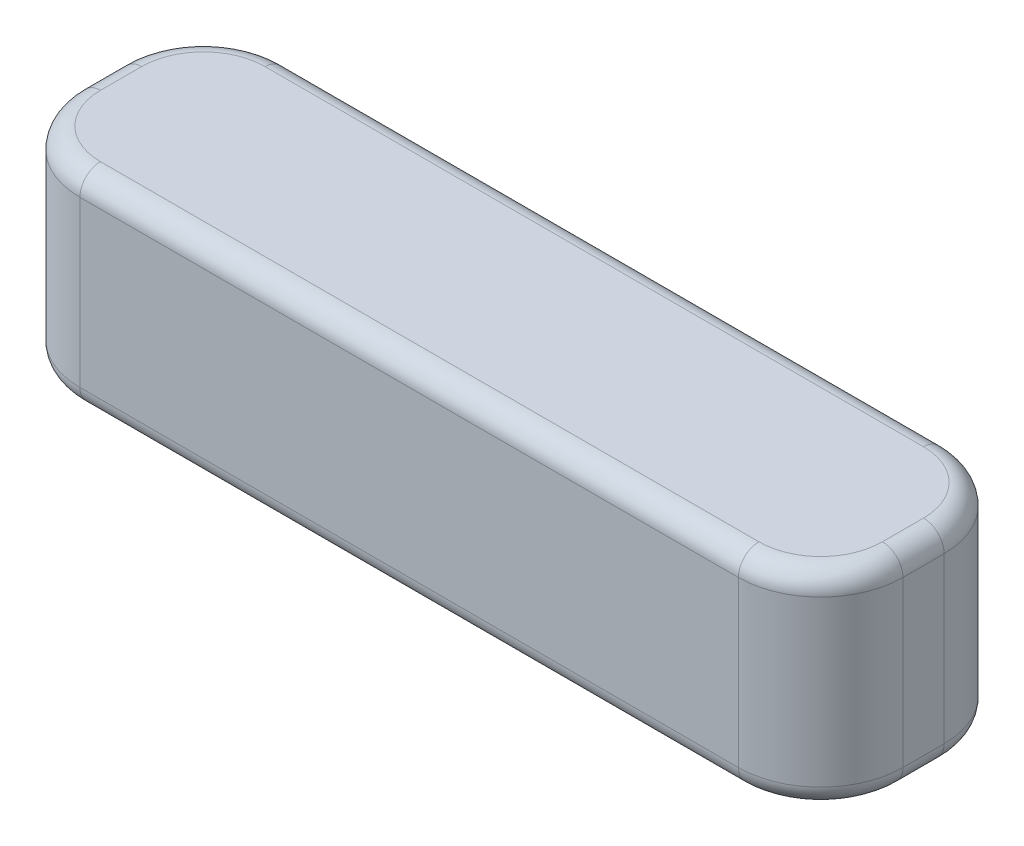
ISO-10303-21;
HEADER;
FILE_DESCRIPTION(('STEP AP214'),'2;1');
FILE_NAME('part.step','',(''),(''),'','','');
FILE_SCHEMA(('AUTOMOTIVE_DESIGN { 1 0 10303 214 1 1 1 1 }'));
ENDSEC;
DATA;
#1=APPLICATION_CONTEXT('core data for automotive mechanical design processes');
#2=APPLICATION_PROTOCOL_DEFINITION('international standard','automotive_design',2000,#1);
#3=PRODUCT_CONTEXT('',#1,'mechanical');
#4=PRODUCT('Part','Part','',(#3));
#5=PRODUCT_RELATED_PRODUCT_CATEGORY('part','',(#4));
#6=PRODUCT_DEFINITION_FORMATION('','',#4);
#7=PRODUCT_DEFINITION_CONTEXT('part definition',#1,'design');
#8=PRODUCT_DEFINITION('design','',#6,#7);
#9=PRODUCT_DEFINITION_SHAPE('','',#8);
#10=(LENGTH_UNIT() NAMED_UNIT(*) SI_UNIT(.MILLI.,.METRE.));
#11=(NAMED_UNIT(*) PLANE_ANGLE_UNIT() SI_UNIT($,.RADIAN.));
#12=(NAMED_UNIT(*) SI_UNIT($,.STERADIAN.) SOLID_ANGLE_UNIT());
#13=UNCERTAINTY_MEASURE_WITH_UNIT(LENGTH_MEASURE(1.E-05),#10,'distance_accuracy_value','');
#14=(GEOMETRIC_REPRESENTATION_CONTEXT(3) GLOBAL_UNCERTAINTY_ASSIGNED_CONTEXT((#13)) GLOBAL_UNIT_ASSIGNED_CONTEXT((#10,
#11,#12)) REPRESENTATION_CONTEXT('',''));
#15=CARTESIAN_POINT('',(0.,0.,0.));
#16=DIRECTION('',(0.,0.,1.));
#17=DIRECTION('',(1.,0.,0.));
#18=AXIS2_PLACEMENT_3D('',#15,#16,#17);
#19=CARTESIAN_POINT('',(10.,5.,-2.5));
#20=DIRECTION('',(-1.,0.,0.));
#21=DIRECTION('',(0.,0.,1.));
#22=AXIS2_PLACEMENT_3D('',#19,#20,#21);
#23=PLANE('',#22);
#24=DIRECTION('',(0.,-1.,0.));
#25=VECTOR('',#24,1.);
#26=CARTESIAN_POINT('',(10.,5.,0.5));
#27=LINE('',#26,#25);
#28=CARTESIAN_POINT('',(10.,4.5,0.5));
#29=VERTEX_POINT('',#28);
#30=CARTESIAN_POINT('',(10.,0.5,0.5));
#31=VERTEX_POINT('',#30);
#32=EDGE_CURVE('E172',#29,#31,#27,.T.);
#33=ORIENTED_EDGE('',*,*,#32,.T.);
#34=DIRECTION('',(0.,0.,-1.));
#35=VECTOR('',#34,1.);
#36=CARTESIAN_POINT('',(10.,0.5,-2.5));
#37=LINE('',#36,#35);
#38=CARTESIAN_POINT('',(10.,0.5,-0.5));
#39=VERTEX_POINT('',#38);
#40=EDGE_CURVE('E214',#31,#39,#37,.T.);
#41=ORIENTED_EDGE('',*,*,#40,.T.);
#42=DIRECTION('',(0.,-1.,0.));
#43=VECTOR('',#42,1.);
#44=CARTESIAN_POINT('',(10.,5.,-0.5));
#45=LINE('',#44,#43);
#46=CARTESIAN_POINT('',(10.,4.5,-0.5));
#47=VERTEX_POINT('',#46);
#48=EDGE_CURVE('E175',#39,#47,#45,.F.);
#49=ORIENTED_EDGE('',*,*,#48,.T.);
#50=DIRECTION('',(0.,0.,-1.));
#51=VECTOR('',#50,1.);
#52=CARTESIAN_POINT('',(10.,4.5,0.5));
#53=LINE('',#52,#51);
#54=EDGE_CURVE('E212',#47,#29,#53,.F.);
#55=ORIENTED_EDGE('',*,*,#54,.T.);
#56=EDGE_LOOP('',(#33,#41,#49,#55));
#57=FACE_BOUND('',#56,.T.);
#58=ADVANCED_FACE('F33',(#57),#23,.F.);
#59=CARTESIAN_POINT('',(-10.,5.,-2.5));
#60=DIRECTION('',(0.,0.,1.));
#61=DIRECTION('',(1.,0.,0.));
#62=AXIS2_PLACEMENT_3D('',#59,#60,#61);
#63=PLANE('',#62);
#64=DIRECTION('',(0.,-1.,0.));
#65=VECTOR('',#64,1.);
#66=CARTESIAN_POINT('',(8.,5.,-2.5));
#67=LINE('',#66,#65);
#68=CARTESIAN_POINT('',(8.,4.5,-2.5));
#69=VERTEX_POINT('',#68);
#70=CARTESIAN_POINT('',(8.,0.5,-2.5));
#71=VERTEX_POINT('',#70);
#72=EDGE_CURVE('E288',#69,#71,#67,.T.);
#73=ORIENTED_EDGE('',*,*,#72,.T.);
#74=DIRECTION('',(-1.,0.,0.));
#75=VECTOR('',#74,1.);
#76=CARTESIAN_POINT('',(-10.,0.5,-2.5));
#77=LINE('',#76,#75);
#78=CARTESIAN_POINT('',(-8.,0.5,-2.5));
#79=VERTEX_POINT('',#78);
#80=EDGE_CURVE('E206',#71,#79,#77,.T.);
#81=ORIENTED_EDGE('',*,*,#80,.T.);
#82=DIRECTION('',(0.,-1.,0.));
#83=VECTOR('',#82,1.);
#84=CARTESIAN_POINT('',(-8.,5.,-2.5));
#85=LINE('',#84,#83);
#86=CARTESIAN_POINT('',(-8.,4.5,-2.5));
#87=VERTEX_POINT('',#86);
#88=EDGE_CURVE('E299',#79,#87,#85,.F.);
#89=ORIENTED_EDGE('',*,*,#88,.T.);
#90=DIRECTION('',(-1.,0.,0.));
#91=VECTOR('',#90,1.);
#92=CARTESIAN_POINT('',(8.,4.5,-2.5));
#93=LINE('',#92,#91);
#94=EDGE_CURVE('E204',#87,#69,#93,.F.);
#95=ORIENTED_EDGE('',*,*,#94,.T.);
#96=EDGE_LOOP('',(#73,#81,#89,#95));
#97=FACE_BOUND('',#96,.T.);
#98=ADVANCED_FACE('F350',(#97),#63,.F.);
#99=CARTESIAN_POINT('',(-10.,5.,-2.5));
#100=DIRECTION('',(1.,0.,0.));
#101=DIRECTION('',(0.,0.,-1.));
#102=AXIS2_PLACEMENT_3D('',#99,#100,#101);
#103=PLANE('',#102);
#104=DIRECTION('',(0.,-1.,0.));
#105=VECTOR('',#104,1.);
#106=CARTESIAN_POINT('',(-10.,5.,-0.5));
#107=LINE('',#106,#105);
#108=CARTESIAN_POINT('',(-10.,4.5,-0.5));
#109=VERTEX_POINT('',#108);
#110=CARTESIAN_POINT('',(-10.,0.5,-0.5));
#111=VERTEX_POINT('',#110);
#112=EDGE_CURVE('E303',#109,#111,#107,.T.);
#113=ORIENTED_EDGE('',*,*,#112,.T.);
#114=DIRECTION('',(0.,0.,1.));
#115=VECTOR('',#114,1.);
#116=CARTESIAN_POINT('',(-10.,0.5,-2.5));
#117=LINE('',#116,#115);
#118=CARTESIAN_POINT('',(-10.,0.5,0.5));
#119=VERTEX_POINT('',#118);
#120=EDGE_CURVE('E198',#111,#119,#117,.T.);
#121=ORIENTED_EDGE('',*,*,#120,.T.);
#122=DIRECTION('',(0.,-1.,0.));
#123=VECTOR('',#122,1.);
#124=CARTESIAN_POINT('',(-10.,5.,0.5));
#125=LINE('',#124,#123);
#126=CARTESIAN_POINT('',(-10.,4.5,0.5));
#127=VERTEX_POINT('',#126);
#128=EDGE_CURVE('E249',#119,#127,#125,.F.);
#129=ORIENTED_EDGE('',*,*,#128,.T.);
#130=DIRECTION('',(0.,0.,1.));
#131=VECTOR('',#130,1.);
#132=CARTESIAN_POINT('',(-10.,4.5,-0.5));
#133=LINE('',#132,#131);
#134=EDGE_CURVE('E196',#127,#109,#133,.F.);
#135=ORIENTED_EDGE('',*,*,#134,.T.);
#136=EDGE_LOOP('',(#113,#121,#129,#135));
#137=FACE_BOUND('',#136,.T.);
#138=ADVANCED_FACE('F309',(#137),#103,.F.);
#139=CARTESIAN_POINT('',(-10.,5.,2.5));
#140=DIRECTION('',(0.,0.,-1.));
#141=DIRECTION('',(-1.,0.,0.));
#142=AXIS2_PLACEMENT_3D('',#139,#140,#141);
#143=PLANE('',#142);
#144=DIRECTION('',(0.,-1.,0.));
#145=VECTOR('',#144,1.);
#146=CARTESIAN_POINT('',(-8.,5.,2.5));
#147=LINE('',#146,#145);
#148=CARTESIAN_POINT('',(-8.,4.5,2.5));
#149=VERTEX_POINT('',#148);
#150=CARTESIAN_POINT('',(-8.,0.5,2.5));
#151=VERTEX_POINT('',#150);
#152=EDGE_CURVE('E292',#149,#151,#147,.T.);
#153=ORIENTED_EDGE('',*,*,#152,.T.);
#154=DIRECTION('',(1.,0.,0.));
#155=VECTOR('',#154,1.);
#156=CARTESIAN_POINT('',(-10.,0.5,2.5));
#157=LINE('',#156,#155);
#158=CARTESIAN_POINT('',(8.,0.5,2.5));
#159=VERTEX_POINT('',#158);
#160=EDGE_CURVE('E11',#151,#159,#157,.T.);
#161=ORIENTED_EDGE('',*,*,#160,.T.);
#162=DIRECTION('',(0.,-1.,0.));
#163=VECTOR('',#162,1.);
#164=CARTESIAN_POINT('',(8.,5.,2.5));
#165=LINE('',#164,#163);
#166=CARTESIAN_POINT('',(8.,4.5,2.5));
#167=VERTEX_POINT('',#166);
#168=EDGE_CURVE('E294',#159,#167,#165,.F.);
#169=ORIENTED_EDGE('',*,*,#168,.T.);
#170=DIRECTION('',(1.,0.,0.));
#171=VECTOR('',#170,1.);
#172=CARTESIAN_POINT('',(-8.,4.5,2.5));
#173=LINE('',#172,#171);
#174=EDGE_CURVE('E42',#167,#149,#173,.F.);
#175=ORIENTED_EDGE('',*,*,#174,.T.);
#176=EDGE_LOOP('',(#153,#161,#169,#175));
#177=FACE_BOUND('',#176,.T.);
#178=ADVANCED_FACE('F532',(#177),#143,.F.);
#179=CARTESIAN_POINT('',(0.,5.,0.));
#180=DIRECTION('',(0.,1.,0.));
#181=DIRECTION('',(0.,0.,1.));
#182=AXIS2_PLACEMENT_3D('',#179,#180,#181);
#183=PLANE('',#182);
#184=DIRECTION('',(0.,0.,1.));
#185=VECTOR('',#184,1.);
#186=CARTESIAN_POINT('',(-9.5,5.,0.5));
#187=LINE('',#186,#185);
#188=CARTESIAN_POINT('',(-9.5,5.,-0.5));
#189=VERTEX_POINT('',#188);
#190=CARTESIAN_POINT('',(-9.5,5.,0.5));
#191=VERTEX_POINT('',#190);
#192=EDGE_CURVE('E50',#189,#191,#187,.T.);
#193=ORIENTED_EDGE('',*,*,#192,.T.);
#194=CARTESIAN_POINT('',(-8.,5.,0.5));
#195=DIRECTION('',(0.,1.,0.));
#196=DIRECTION('',(0.,0.,1.));
#197=AXIS2_PLACEMENT_3D('',#194,#195,#196);
#198=CIRCLE('',#197,1.5);
#199=CARTESIAN_POINT('',(-8.,5.,2.));
#200=VERTEX_POINT('',#199);
#201=EDGE_CURVE('E231',#191,#200,#198,.T.);
#202=ORIENTED_EDGE('',*,*,#201,.T.);
#203=DIRECTION('',(1.,0.,0.));
#204=VECTOR('',#203,1.);
#205=CARTESIAN_POINT('',(8.,5.,2.));
#206=LINE('',#205,#204);
#207=CARTESIAN_POINT('',(8.,5.,2.));
#208=VERTEX_POINT('',#207);
#209=EDGE_CURVE('E219',#200,#208,#206,.T.);
#210=ORIENTED_EDGE('',*,*,#209,.T.);
#211=CARTESIAN_POINT('',(8.,5.,0.5));
#212=DIRECTION('',(0.,1.,0.));
#213=DIRECTION('',(0.,0.,1.));
#214=AXIS2_PLACEMENT_3D('',#211,#212,#213);
#215=CIRCLE('',#214,1.5);
#216=CARTESIAN_POINT('',(9.5,5.,0.5));
#217=VERTEX_POINT('',#216);
#218=EDGE_CURVE('E221',#208,#217,#215,.T.);
#219=ORIENTED_EDGE('',*,*,#218,.T.);
#220=DIRECTION('',(0.,0.,-1.));
#221=VECTOR('',#220,1.);
#222=CARTESIAN_POINT('',(9.5,5.,-0.5));
#223=LINE('',#222,#221);
#224=CARTESIAN_POINT('',(9.5,5.,-0.5));
#225=VERTEX_POINT('',#224);
#226=EDGE_CURVE('E223',#217,#225,#223,.T.);
#227=ORIENTED_EDGE('',*,*,#226,.T.);
#228=CARTESIAN_POINT('',(8.,5.,-0.5));
#229=DIRECTION('',(0.,1.,0.));
#230=DIRECTION('',(0.,0.,1.));
#231=AXIS2_PLACEMENT_3D('',#228,#229,#230);
#232=CIRCLE('',#231,1.5);
#233=CARTESIAN_POINT('',(8.,5.,-2.));
#234=VERTEX_POINT('',#233);
#235=EDGE_CURVE('E225',#225,#234,#232,.T.);
#236=ORIENTED_EDGE('',*,*,#235,.T.);
#237=DIRECTION('',(-1.,0.,0.));
#238=VECTOR('',#237,1.);
#239=CARTESIAN_POINT('',(-8.,5.,-2.));
#240=LINE('',#239,#238);
#241=CARTESIAN_POINT('',(-8.,5.,-2.));
#242=VERTEX_POINT('',#241);
#243=EDGE_CURVE('E227',#234,#242,#240,.T.);
#244=ORIENTED_EDGE('',*,*,#243,.T.);
#245=CARTESIAN_POINT('',(-8.,5.,-0.5));
#246=DIRECTION('',(0.,1.,0.));
#247=DIRECTION('',(0.,0.,1.));
#248=AXIS2_PLACEMENT_3D('',#245,#246,#247);
#249=CIRCLE('',#248,1.5);
#250=EDGE_CURVE('E55',#242,#189,#249,.T.);
#251=ORIENTED_EDGE('',*,*,#250,.T.);
#252=EDGE_LOOP('',(#193,#202,#210,#219,#227,#236,#244,#251));
#253=FACE_BOUND('',#252,.T.);
#254=ADVANCED_FACE('F524',(#253),#183,.T.);
#255=CARTESIAN_POINT('',(0.,0.,0.));
#256=DIRECTION('',(0.,1.,0.));
#257=DIRECTION('',(0.,0.,1.));
#258=AXIS2_PLACEMENT_3D('',#255,#256,#257);
#259=PLANE('',#258);
#260=DIRECTION('',(1.,0.,0.));
#261=VECTOR('',#260,1.);
#262=CARTESIAN_POINT('',(0.,0.,2.));
#263=LINE('',#262,#261);
#264=CARTESIAN_POINT('',(8.,0.,2.));
#265=VERTEX_POINT('',#264);
#266=CARTESIAN_POINT('',(-8.,0.,2.));
#267=VERTEX_POINT('',#266);
#268=EDGE_CURVE('E151',#265,#267,#263,.F.);
#269=ORIENTED_EDGE('',*,*,#268,.T.);
#270=CARTESIAN_POINT('',(-8.,0.,0.5));
#271=DIRECTION('',(0.,1.,0.));
#272=DIRECTION('',(0.,0.,1.));
#273=AXIS2_PLACEMENT_3D('',#270,#271,#272);
#274=CIRCLE('',#273,1.5);
#275=CARTESIAN_POINT('',(-9.5,0.,0.5));
#276=VERTEX_POINT('',#275);
#277=EDGE_CURVE('E188',#267,#276,#274,.F.);
#278=ORIENTED_EDGE('',*,*,#277,.T.);
#279=DIRECTION('',(0.,0.,1.));
#280=VECTOR('',#279,1.);
#281=CARTESIAN_POINT('',(-9.5,0.,0.));
#282=LINE('',#281,#280);
#283=CARTESIAN_POINT('',(-9.5,0.,-0.5));
#284=VERTEX_POINT('',#283);
#285=EDGE_CURVE('E186',#276,#284,#282,.F.);
#286=ORIENTED_EDGE('',*,*,#285,.T.);
#287=CARTESIAN_POINT('',(-8.,0.,-0.5));
#288=DIRECTION('',(0.,1.,0.));
#289=DIRECTION('',(0.,0.,1.));
#290=AXIS2_PLACEMENT_3D('',#287,#288,#289);
#291=CIRCLE('',#290,1.5);
#292=CARTESIAN_POINT('',(-8.,0.,-2.));
#293=VERTEX_POINT('',#292);
#294=EDGE_CURVE('E184',#284,#293,#291,.F.);
#295=ORIENTED_EDGE('',*,*,#294,.T.);
#296=DIRECTION('',(-1.,0.,0.));
#297=VECTOR('',#296,1.);
#298=CARTESIAN_POINT('',(0.,0.,-2.));
#299=LINE('',#298,#297);
#300=CARTESIAN_POINT('',(8.,0.,-2.));
#301=VERTEX_POINT('',#300);
#302=EDGE_CURVE('E182',#293,#301,#299,.F.);
#303=ORIENTED_EDGE('',*,*,#302,.T.);
#304=CARTESIAN_POINT('',(8.,0.,-0.5));
#305=DIRECTION('',(0.,1.,0.));
#306=DIRECTION('',(0.,0.,1.));
#307=AXIS2_PLACEMENT_3D('',#304,#305,#306);
#308=CIRCLE('',#307,1.5);
#309=CARTESIAN_POINT('',(9.5,0.,-0.5));
#310=VERTEX_POINT('',#309);
#311=EDGE_CURVE('E180',#301,#310,#308,.F.);
#312=ORIENTED_EDGE('',*,*,#311,.T.);
#313=DIRECTION('',(0.,0.,-1.));
#314=VECTOR('',#313,1.);
#315=CARTESIAN_POINT('',(9.5,0.,0.));
#316=LINE('',#315,#314);
#317=CARTESIAN_POINT('',(9.5,0.,0.5));
#318=VERTEX_POINT('',#317);
#319=EDGE_CURVE('E154',#310,#318,#316,.F.);
#320=ORIENTED_EDGE('',*,*,#319,.T.);
#321=CARTESIAN_POINT('',(8.,0.,0.5));
#322=DIRECTION('',(0.,1.,0.));
#323=DIRECTION('',(0.,0.,1.));
#324=AXIS2_PLACEMENT_3D('',#321,#322,#323);
#325=CIRCLE('',#324,1.5);
#326=EDGE_CURVE('E146',#318,#265,#325,.F.);
#327=ORIENTED_EDGE('',*,*,#326,.T.);
#328=EDGE_LOOP('',(#269,#278,#286,#295,#303,#312,#320,#327));
#329=FACE_BOUND('',#328,.T.);
#330=ADVANCED_FACE('F148',(#329),#259,.F.);
#331=CARTESIAN_POINT('',(-8.,5.,-0.5));
#332=DIRECTION('',(0.,-1.,0.));
#333=DIRECTION('',(0.,0.,-1.));
#334=AXIS2_PLACEMENT_3D('',#331,#332,#333);
#335=CYLINDRICAL_SURFACE('',#334,2.);
#336=ORIENTED_EDGE('',*,*,#88,.F.);
#337=CARTESIAN_POINT('',(-8.,0.5,-0.5));
#338=DIRECTION('',(0.,1.,0.));
#339=DIRECTION('',(0.,0.,1.));
#340=AXIS2_PLACEMENT_3D('',#337,#338,#339);
#341=CIRCLE('',#340,2.);
#342=EDGE_CURVE('E202',#79,#111,#341,.T.);
#343=ORIENTED_EDGE('',*,*,#342,.T.);
#344=ORIENTED_EDGE('',*,*,#112,.F.);
#345=CARTESIAN_POINT('',(-8.,4.5,-0.5));
#346=DIRECTION('',(0.,1.,0.));
#347=DIRECTION('',(0.,0.,1.));
#348=AXIS2_PLACEMENT_3D('',#345,#346,#347);
#349=CIRCLE('',#348,2.);
#350=EDGE_CURVE('E200',#109,#87,#349,.F.);
#351=ORIENTED_EDGE('',*,*,#350,.T.);
#352=EDGE_LOOP('',(#336,#343,#344,#351));
#353=FACE_BOUND('',#352,.T.);
#354=ADVANCED_FACE('F359',(#353),#335,.T.);
#355=CARTESIAN_POINT('',(-8.,5.,0.5));
#356=DIRECTION('',(0.,-1.,0.));
#357=DIRECTION('',(0.,0.,-1.));
#358=AXIS2_PLACEMENT_3D('',#355,#356,#357);
#359=CYLINDRICAL_SURFACE('',#358,2.);
#360=ORIENTED_EDGE('',*,*,#128,.F.);
#361=CARTESIAN_POINT('',(-8.,0.5,0.5));
#362=DIRECTION('',(0.,1.,0.));
#363=DIRECTION('',(0.,0.,1.));
#364=AXIS2_PLACEMENT_3D('',#361,#362,#363);
#365=CIRCLE('',#364,2.);
#366=EDGE_CURVE('E193',#119,#151,#365,.T.);
#367=ORIENTED_EDGE('',*,*,#366,.T.);
#368=ORIENTED_EDGE('',*,*,#152,.F.);
#369=CARTESIAN_POINT('',(-8.,4.5,0.5));
#370=DIRECTION('',(0.,1.,0.));
#371=DIRECTION('',(0.,0.,1.));
#372=AXIS2_PLACEMENT_3D('',#369,#370,#371);
#373=CIRCLE('',#372,2.);
#374=EDGE_CURVE('E190',#149,#127,#373,.F.);
#375=ORIENTED_EDGE('',*,*,#374,.T.);
#376=EDGE_LOOP('',(#360,#367,#368,#375));
#377=FACE_BOUND('',#376,.T.);
#378=ADVANCED_FACE('F315',(#377),#359,.T.);
#379=CARTESIAN_POINT('',(8.,5.,0.5));
#380=DIRECTION('',(0.,-1.,0.));
#381=DIRECTION('',(0.,0.,-1.));
#382=AXIS2_PLACEMENT_3D('',#379,#380,#381);
#383=CYLINDRICAL_SURFACE('',#382,2.);
#384=ORIENTED_EDGE('',*,*,#168,.F.);
#385=CARTESIAN_POINT('',(8.,0.5,0.5));
#386=DIRECTION('',(0.,1.,0.));
#387=DIRECTION('',(0.,0.,1.));
#388=AXIS2_PLACEMENT_3D('',#385,#386,#387);
#389=CIRCLE('',#388,2.);
#390=EDGE_CURVE('E163',#159,#31,#389,.T.);
#391=ORIENTED_EDGE('',*,*,#390,.T.);
#392=ORIENTED_EDGE('',*,*,#32,.F.);
#393=CARTESIAN_POINT('',(8.,4.5,0.5));
#394=DIRECTION('',(0.,1.,0.));
#395=DIRECTION('',(0.,0.,1.));
#396=AXIS2_PLACEMENT_3D('',#393,#394,#395);
#397=CIRCLE('',#396,2.);
#398=EDGE_CURVE('E216',#29,#167,#397,.F.);
#399=ORIENTED_EDGE('',*,*,#398,.T.);
#400=EDGE_LOOP('',(#384,#391,#392,#399));
#401=FACE_BOUND('',#400,.T.);
#402=ADVANCED_FACE('F365',(#401),#383,.T.);
#403=CARTESIAN_POINT('',(8.,5.,-0.5));
#404=DIRECTION('',(0.,-1.,0.));
#405=DIRECTION('',(0.,0.,-1.));
#406=AXIS2_PLACEMENT_3D('',#403,#404,#405);
#407=CYLINDRICAL_SURFACE('',#406,2.);
#408=ORIENTED_EDGE('',*,*,#48,.F.);
#409=CARTESIAN_POINT('',(8.,0.5,-0.5));
#410=DIRECTION('',(0.,1.,0.));
#411=DIRECTION('',(0.,0.,1.));
#412=AXIS2_PLACEMENT_3D('',#409,#410,#411);
#413=CIRCLE('',#412,2.);
#414=EDGE_CURVE('E210',#39,#71,#413,.T.);
#415=ORIENTED_EDGE('',*,*,#414,.T.);
#416=ORIENTED_EDGE('',*,*,#72,.F.);
#417=CARTESIAN_POINT('',(8.,4.5,-0.5));
#418=DIRECTION('',(0.,1.,0.));
#419=DIRECTION('',(0.,0.,1.));
#420=AXIS2_PLACEMENT_3D('',#417,#418,#419);
#421=CIRCLE('',#420,2.);
#422=EDGE_CURVE('E208',#69,#47,#421,.F.);
#423=ORIENTED_EDGE('',*,*,#422,.T.);
#424=EDGE_LOOP('',(#408,#415,#416,#423));
#425=FACE_BOUND('',#424,.T.);
#426=ADVANCED_FACE('F285',(#425),#407,.T.);
#427=CARTESIAN_POINT('',(8.,0.5,-0.5));
#428=DIRECTION('',(0.,1.,0.));
#429=DIRECTION('',(0.,0.,1.));
#430=AXIS2_PLACEMENT_3D('',#427,#428,#429);
#431=TOROIDAL_SURFACE('',#430,1.5,0.5);
#432=CARTESIAN_POINT('',(8.,0.5,-2.));
#433=DIRECTION('',(-1.,0.,0.));
#434=DIRECTION('',(0.,0.,1.));
#435=AXIS2_PLACEMENT_3D('',#432,#433,#434);
#436=CIRCLE('',#435,0.5);
#437=EDGE_CURVE('E243',#71,#301,#436,.T.);
#438=ORIENTED_EDGE('',*,*,#437,.F.);
#439=ORIENTED_EDGE('',*,*,#414,.F.);
#440=CARTESIAN_POINT('',(9.5,0.5,-0.5));
#441=DIRECTION('',(0.,0.,1.));
#442=DIRECTION('',(1.,0.,0.));
#443=AXIS2_PLACEMENT_3D('',#440,#441,#442);
#444=CIRCLE('',#443,0.5);
#445=EDGE_CURVE('E246',#310,#39,#444,.T.);
#446=ORIENTED_EDGE('',*,*,#445,.F.);
#447=ORIENTED_EDGE('',*,*,#311,.F.);
#448=EDGE_LOOP('',(#438,#439,#446,#447));
#449=FACE_BOUND('',#448,.T.);
#450=ADVANCED_FACE('F338',(#449),#431,.T.);
#451=CARTESIAN_POINT('',(9.5,0.5,-2.5));
#452=DIRECTION('',(0.,0.,-1.));
#453=DIRECTION('',(-1.,0.,0.));
#454=AXIS2_PLACEMENT_3D('',#451,#452,#453);
#455=CYLINDRICAL_SURFACE('',#454,0.5);
#456=ORIENTED_EDGE('',*,*,#445,.T.);
#457=ORIENTED_EDGE('',*,*,#40,.F.);
#458=CARTESIAN_POINT('',(9.5,0.5,0.5));
#459=DIRECTION('',(0.,0.,1.));
#460=DIRECTION('',(1.,0.,0.));
#461=AXIS2_PLACEMENT_3D('',#458,#459,#460);
#462=CIRCLE('',#461,0.5);
#463=EDGE_CURVE('E241',#318,#31,#462,.T.);
#464=ORIENTED_EDGE('',*,*,#463,.F.);
#465=ORIENTED_EDGE('',*,*,#319,.F.);
#466=EDGE_LOOP('',(#456,#457,#464,#465));
#467=FACE_BOUND('',#466,.T.);
#468=ADVANCED_FACE('F340',(#467),#455,.T.);
#469=CARTESIAN_POINT('',(-10.,0.5,-2.));
#470=DIRECTION('',(-1.,0.,0.));
#471=DIRECTION('',(0.,0.,1.));
#472=AXIS2_PLACEMENT_3D('',#469,#470,#471);
#473=CYLINDRICAL_SURFACE('',#472,0.5);
#474=ORIENTED_EDGE('',*,*,#437,.T.);
#475=ORIENTED_EDGE('',*,*,#302,.F.);
#476=CARTESIAN_POINT('',(-8.,0.5,-2.));
#477=DIRECTION('',(-1.,0.,0.));
#478=DIRECTION('',(0.,0.,1.));
#479=AXIS2_PLACEMENT_3D('',#476,#477,#478);
#480=CIRCLE('',#479,0.5);
#481=EDGE_CURVE('E166',#79,#293,#480,.T.);
#482=ORIENTED_EDGE('',*,*,#481,.F.);
#483=ORIENTED_EDGE('',*,*,#80,.F.);
#484=EDGE_LOOP('',(#474,#475,#482,#483));
#485=FACE_BOUND('',#484,.T.);
#486=ADVANCED_FACE('F333',(#485),#473,.T.);
#487=CARTESIAN_POINT('',(8.,0.5,0.5));
#488=DIRECTION('',(0.,1.,0.));
#489=DIRECTION('',(0.,0.,1.));
#490=AXIS2_PLACEMENT_3D('',#487,#488,#489);
#491=TOROIDAL_SURFACE('',#490,1.5,0.5);
#492=ORIENTED_EDGE('',*,*,#463,.T.);
#493=ORIENTED_EDGE('',*,*,#390,.F.);
#494=CARTESIAN_POINT('',(8.,0.5,2.));
#495=DIRECTION('',(-1.,0.,0.));
#496=DIRECTION('',(0.,0.,1.));
#497=AXIS2_PLACEMENT_3D('',#494,#495,#496);
#498=CIRCLE('',#497,0.5);
#499=EDGE_CURVE('E161',#265,#159,#498,.T.);
#500=ORIENTED_EDGE('',*,*,#499,.F.);
#501=ORIENTED_EDGE('',*,*,#326,.F.);
#502=EDGE_LOOP('',(#492,#493,#500,#501));
#503=FACE_BOUND('',#502,.T.);
#504=ADVANCED_FACE('F162',(#503),#491,.T.);
#505=CARTESIAN_POINT('',(-8.,0.5,-0.5));
#506=DIRECTION('',(0.,1.,0.));
#507=DIRECTION('',(0.,0.,1.));
#508=AXIS2_PLACEMENT_3D('',#505,#506,#507);
#509=TOROIDAL_SURFACE('',#508,1.5,0.5);
#510=ORIENTED_EDGE('',*,*,#481,.T.);
#511=ORIENTED_EDGE('',*,*,#294,.F.);
#512=CARTESIAN_POINT('',(-9.5,0.5,-0.5));
#513=DIRECTION('',(0.,0.,1.));
#514=DIRECTION('',(1.,0.,0.));
#515=AXIS2_PLACEMENT_3D('',#512,#513,#514);
#516=CIRCLE('',#515,0.5);
#517=EDGE_CURVE('E167',#111,#284,#516,.T.);
#518=ORIENTED_EDGE('',*,*,#517,.F.);
#519=ORIENTED_EDGE('',*,*,#342,.F.);
#520=EDGE_LOOP('',(#510,#511,#518,#519));
#521=FACE_BOUND('',#520,.T.);
#522=ADVANCED_FACE('F328',(#521),#509,.T.);
#523=CARTESIAN_POINT('',(-10.,0.5,2.));
#524=DIRECTION('',(1.,0.,0.));
#525=DIRECTION('',(0.,0.,-1.));
#526=AXIS2_PLACEMENT_3D('',#523,#524,#525);
#527=CYLINDRICAL_SURFACE('',#526,0.5);
#528=ORIENTED_EDGE('',*,*,#499,.T.);
#529=ORIENTED_EDGE('',*,*,#160,.F.);
#530=CARTESIAN_POINT('',(-8.,0.5,2.));
#531=DIRECTION('',(-1.,0.,0.));
#532=DIRECTION('',(0.,0.,1.));
#533=AXIS2_PLACEMENT_3D('',#530,#531,#532);
#534=CIRCLE('',#533,0.5);
#535=EDGE_CURVE('E170',#267,#151,#534,.T.);
#536=ORIENTED_EDGE('',*,*,#535,.F.);
#537=ORIENTED_EDGE('',*,*,#268,.F.);
#538=EDGE_LOOP('',(#528,#529,#536,#537));
#539=FACE_BOUND('',#538,.T.);
#540=ADVANCED_FACE('F169',(#539),#527,.T.);
#541=CARTESIAN_POINT('',(-9.5,0.5,-2.5));
#542=DIRECTION('',(0.,0.,1.));
#543=DIRECTION('',(1.,0.,0.));
#544=AXIS2_PLACEMENT_3D('',#541,#542,#543);
#545=CYLINDRICAL_SURFACE('',#544,0.5);
#546=ORIENTED_EDGE('',*,*,#517,.T.);
#547=ORIENTED_EDGE('',*,*,#285,.F.);
#548=CARTESIAN_POINT('',(-9.5,0.5,0.5));
#549=DIRECTION('',(0.,0.,1.));
#550=DIRECTION('',(1.,0.,0.));
#551=AXIS2_PLACEMENT_3D('',#548,#549,#550);
#552=CIRCLE('',#551,0.5);
#553=EDGE_CURVE('E234',#119,#276,#552,.T.);
#554=ORIENTED_EDGE('',*,*,#553,.F.);
#555=ORIENTED_EDGE('',*,*,#120,.F.);
#556=EDGE_LOOP('',(#546,#547,#554,#555));
#557=FACE_BOUND('',#556,.T.);
#558=ADVANCED_FACE('F323',(#557),#545,.T.);
#559=CARTESIAN_POINT('',(-8.,0.5,0.5));
#560=DIRECTION('',(0.,1.,0.));
#561=DIRECTION('',(0.,0.,1.));
#562=AXIS2_PLACEMENT_3D('',#559,#560,#561);
#563=TOROIDAL_SURFACE('',#562,1.5,0.5);
#564=ORIENTED_EDGE('',*,*,#535,.T.);
#565=ORIENTED_EDGE('',*,*,#366,.F.);
#566=ORIENTED_EDGE('',*,*,#553,.T.);
#567=ORIENTED_EDGE('',*,*,#277,.F.);
#568=EDGE_LOOP('',(#564,#565,#566,#567));
#569=FACE_BOUND('',#568,.T.);
#570=ADVANCED_FACE('F320',(#569),#563,.T.);
#571=CARTESIAN_POINT('',(8.,4.5,-0.5));
#572=DIRECTION('',(0.,1.,0.));
#573=DIRECTION('',(0.,0.,1.));
#574=AXIS2_PLACEMENT_3D('',#571,#572,#573);
#575=TOROIDAL_SURFACE('',#574,1.5,0.5);
#576=CARTESIAN_POINT('',(9.5,4.5,-0.5));
#577=DIRECTION('',(0.,0.,1.));
#578=DIRECTION('',(1.,0.,0.));
#579=AXIS2_PLACEMENT_3D('',#576,#577,#578);
#580=CIRCLE('',#579,0.5);
#581=EDGE_CURVE('E265',#47,#225,#580,.T.);
#582=ORIENTED_EDGE('',*,*,#581,.F.);
#583=ORIENTED_EDGE('',*,*,#422,.F.);
#584=CARTESIAN_POINT('',(8.,4.5,-2.));
#585=DIRECTION('',(-1.,0.,0.));
#586=DIRECTION('',(0.,0.,1.));
#587=AXIS2_PLACEMENT_3D('',#584,#585,#586);
#588=CIRCLE('',#587,0.5);
#589=EDGE_CURVE('E37',#234,#69,#588,.T.);
#590=ORIENTED_EDGE('',*,*,#589,.F.);
#591=ORIENTED_EDGE('',*,*,#235,.F.);
#592=EDGE_LOOP('',(#582,#583,#590,#591));
#593=FACE_BOUND('',#592,.T.);
#594=ADVANCED_FACE('F35',(#593),#575,.T.);
#595=CARTESIAN_POINT('',(0.,4.5,-2.));
#596=DIRECTION('',(1.,0.,0.));
#597=DIRECTION('',(0.,0.,-1.));
#598=AXIS2_PLACEMENT_3D('',#595,#596,#597);
#599=CYLINDRICAL_SURFACE('',#598,0.5);
#600=ORIENTED_EDGE('',*,*,#589,.T.);
#601=ORIENTED_EDGE('',*,*,#94,.F.);
#602=CARTESIAN_POINT('',(-8.,4.5,-2.));
#603=DIRECTION('',(-1.,0.,0.));
#604=DIRECTION('',(0.,0.,1.));
#605=AXIS2_PLACEMENT_3D('',#602,#603,#604);
#606=CIRCLE('',#605,0.5);
#607=EDGE_CURVE('E263',#242,#87,#606,.T.);
#608=ORIENTED_EDGE('',*,*,#607,.F.);
#609=ORIENTED_EDGE('',*,*,#243,.F.);
#610=EDGE_LOOP('',(#600,#601,#608,#609));
#611=FACE_BOUND('',#610,.T.);
#612=ADVANCED_FACE('F276',(#611),#599,.T.);
#613=CARTESIAN_POINT('',(9.5,4.5,0.));
#614=DIRECTION('',(0.,0.,1.));
#615=DIRECTION('',(1.,0.,0.));
#616=AXIS2_PLACEMENT_3D('',#613,#614,#615);
#617=CYLINDRICAL_SURFACE('',#616,0.5);
#618=ORIENTED_EDGE('',*,*,#581,.T.);
#619=ORIENTED_EDGE('',*,*,#226,.F.);
#620=CARTESIAN_POINT('',(9.5,4.5,0.5));
#621=DIRECTION('',(0.,0.,1.));
#622=DIRECTION('',(1.,0.,0.));
#623=AXIS2_PLACEMENT_3D('',#620,#621,#622);
#624=CIRCLE('',#623,0.5);
#625=EDGE_CURVE('E260',#29,#217,#624,.T.);
#626=ORIENTED_EDGE('',*,*,#625,.F.);
#627=ORIENTED_EDGE('',*,*,#54,.F.);
#628=EDGE_LOOP('',(#618,#619,#626,#627));
#629=FACE_BOUND('',#628,.T.);
#630=ADVANCED_FACE('F411',(#629),#617,.T.);
#631=CARTESIAN_POINT('',(-8.,4.5,-0.5));
#632=DIRECTION('',(0.,1.,0.));
#633=DIRECTION('',(0.,0.,1.));
#634=AXIS2_PLACEMENT_3D('',#631,#632,#633);
#635=TOROIDAL_SURFACE('',#634,1.5,0.5);
#636=ORIENTED_EDGE('',*,*,#607,.T.);
#637=ORIENTED_EDGE('',*,*,#350,.F.);
#638=CARTESIAN_POINT('',(-9.5,4.5,-0.5));
#639=DIRECTION('',(0.,0.,1.));
#640=DIRECTION('',(1.,0.,0.));
#641=AXIS2_PLACEMENT_3D('',#638,#639,#640);
#642=CIRCLE('',#641,0.5);
#643=EDGE_CURVE('E257',#189,#109,#642,.T.);
#644=ORIENTED_EDGE('',*,*,#643,.F.);
#645=ORIENTED_EDGE('',*,*,#250,.F.);
#646=EDGE_LOOP('',(#636,#637,#644,#645));
#647=FACE_BOUND('',#646,.T.);
#648=ADVANCED_FACE('F417',(#647),#635,.T.);
#649=CARTESIAN_POINT('',(8.,4.5,0.5));
#650=DIRECTION('',(0.,1.,0.));
#651=DIRECTION('',(0.,0.,1.));
#652=AXIS2_PLACEMENT_3D('',#649,#650,#651);
#653=TOROIDAL_SURFACE('',#652,1.5,0.5);
#654=ORIENTED_EDGE('',*,*,#625,.T.);
#655=ORIENTED_EDGE('',*,*,#218,.F.);
#656=CARTESIAN_POINT('',(8.,4.5,2.));
#657=DIRECTION('',(-1.,0.,0.));
#658=DIRECTION('',(0.,0.,1.));
#659=AXIS2_PLACEMENT_3D('',#656,#657,#658);
#660=CIRCLE('',#659,0.5);
#661=EDGE_CURVE('E254',#167,#208,#660,.T.);
#662=ORIENTED_EDGE('',*,*,#661,.F.);
#663=ORIENTED_EDGE('',*,*,#398,.F.);
#664=EDGE_LOOP('',(#654,#655,#662,#663));
#665=FACE_BOUND('',#664,.T.);
#666=ADVANCED_FACE('F424',(#665),#653,.T.);
#667=CARTESIAN_POINT('',(-9.5,4.5,0.));
#668=DIRECTION('',(0.,0.,-1.));
#669=DIRECTION('',(-1.,0.,0.));
#670=AXIS2_PLACEMENT_3D('',#667,#668,#669);
#671=CYLINDRICAL_SURFACE('',#670,0.5);
#672=ORIENTED_EDGE('',*,*,#643,.T.);
#673=ORIENTED_EDGE('',*,*,#134,.F.);
#674=CARTESIAN_POINT('',(-9.5,4.5,0.5));
#675=DIRECTION('',(0.,0.,1.));
#676=DIRECTION('',(1.,0.,0.));
#677=AXIS2_PLACEMENT_3D('',#674,#675,#676);
#678=CIRCLE('',#677,0.5);
#679=EDGE_CURVE('E252',#191,#127,#678,.T.);
#680=ORIENTED_EDGE('',*,*,#679,.F.);
#681=ORIENTED_EDGE('',*,*,#192,.F.);
#682=EDGE_LOOP('',(#672,#673,#680,#681));
#683=FACE_BOUND('',#682,.T.);
#684=ADVANCED_FACE('F432',(#683),#671,.T.);
#685=CARTESIAN_POINT('',(0.,4.5,2.));
#686=DIRECTION('',(-1.,0.,0.));
#687=DIRECTION('',(0.,0.,1.));
#688=AXIS2_PLACEMENT_3D('',#685,#686,#687);
#689=CYLINDRICAL_SURFACE('',#688,0.5);
#690=ORIENTED_EDGE('',*,*,#661,.T.);
#691=ORIENTED_EDGE('',*,*,#209,.F.);
#692=CARTESIAN_POINT('',(-8.,4.5,2.));
#693=DIRECTION('',(-1.,0.,0.));
#694=DIRECTION('',(0.,0.,1.));
#695=AXIS2_PLACEMENT_3D('',#692,#693,#694);
#696=CIRCLE('',#695,0.5);
#697=EDGE_CURVE('E250',#149,#200,#696,.T.);
#698=ORIENTED_EDGE('',*,*,#697,.F.);
#699=ORIENTED_EDGE('',*,*,#174,.F.);
#700=EDGE_LOOP('',(#690,#691,#698,#699));
#701=FACE_BOUND('',#700,.T.);
#702=ADVANCED_FACE('F440',(#701),#689,.T.);
#703=CARTESIAN_POINT('',(-8.,4.5,0.5));
#704=DIRECTION('',(0.,1.,0.));
#705=DIRECTION('',(0.,0.,1.));
#706=AXIS2_PLACEMENT_3D('',#703,#704,#705);
#707=TOROIDAL_SURFACE('',#706,1.5,0.5);
#708=ORIENTED_EDGE('',*,*,#679,.T.);
#709=ORIENTED_EDGE('',*,*,#374,.F.);
#710=ORIENTED_EDGE('',*,*,#697,.T.);
#711=ORIENTED_EDGE('',*,*,#201,.F.);
#712=EDGE_LOOP('',(#708,#709,#710,#711));
#713=FACE_BOUND('',#712,.T.);
#714=ADVANCED_FACE('F448',(#713),#707,.T.);
#715=CLOSED_SHELL('',(#58,#98,#138,#178,#254,#330,#354,#378,#402,#426,#450,#468,#486,#504,#522,
#540,#558,#570,#594,#612,#630,#648,#666,#684,#702,#714));
#716=MANIFOLD_SOLID_BREP('B2',#715);
#717=ADVANCED_BREP_SHAPE_REPRESENTATION('',(#18,#716),#14);
#718=SHAPE_DEFINITION_REPRESENTATION(#9,#717);
ENDSEC;
END-ISO-10303-21;
